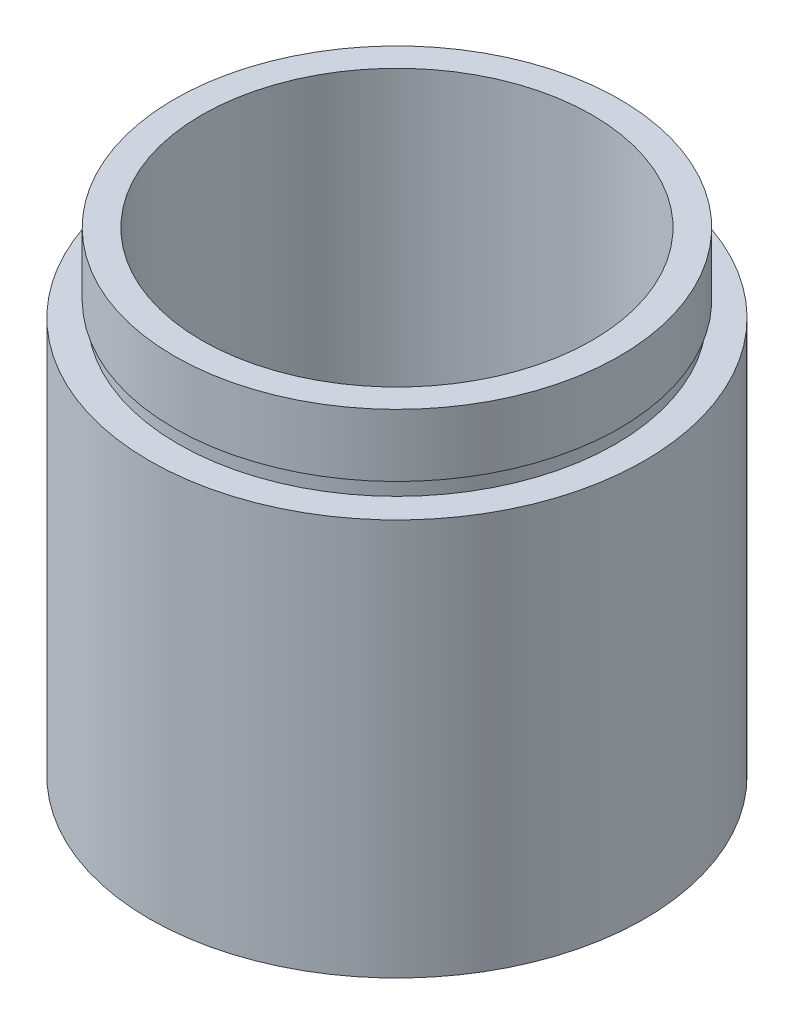
ISO-10303-21;
HEADER;
FILE_DESCRIPTION(('STEP AP214'),'2;1');
FILE_NAME('part.step','',(''),(''),'','','');
FILE_SCHEMA(('AUTOMOTIVE_DESIGN { 1 0 10303 214 1 1 1 1 }'));
ENDSEC;
DATA;
#1=APPLICATION_CONTEXT('core data for automotive mechanical design processes');
#2=APPLICATION_PROTOCOL_DEFINITION('international standard','automotive_design',2000,#1);
#3=PRODUCT_CONTEXT('',#1,'mechanical');
#4=PRODUCT('Part','Part','',(#3));
#5=PRODUCT_RELATED_PRODUCT_CATEGORY('part','',(#4));
#6=PRODUCT_DEFINITION_FORMATION('','',#4);
#7=PRODUCT_DEFINITION_CONTEXT('part definition',#1,'design');
#8=PRODUCT_DEFINITION('design','',#6,#7);
#9=PRODUCT_DEFINITION_SHAPE('','',#8);
#10=(LENGTH_UNIT() NAMED_UNIT(*) SI_UNIT(.MILLI.,.METRE.));
#11=(NAMED_UNIT(*) PLANE_ANGLE_UNIT() SI_UNIT($,.RADIAN.));
#12=(NAMED_UNIT(*) SI_UNIT($,.STERADIAN.) SOLID_ANGLE_UNIT());
#13=UNCERTAINTY_MEASURE_WITH_UNIT(LENGTH_MEASURE(1.E-05),#10,'distance_accuracy_value','');
#14=(GEOMETRIC_REPRESENTATION_CONTEXT(3) GLOBAL_UNCERTAINTY_ASSIGNED_CONTEXT((#13)) GLOBAL_UNIT_ASSIGNED_CONTEXT((#10,
#11,#12)) REPRESENTATION_CONTEXT('',''));
#15=CARTESIAN_POINT('',(0.,0.,0.));
#16=DIRECTION('',(0.,0.,1.));
#17=DIRECTION('',(1.,0.,0.));
#18=AXIS2_PLACEMENT_3D('',#15,#16,#17);
#19=CARTESIAN_POINT('',(14.25,0.,0.));
#20=DIRECTION('',(0.,1.,0.));
#21=DIRECTION('',(0.,0.,1.));
#22=AXIS2_PLACEMENT_3D('',#19,#20,#21);
#23=PLANE('',#22);
#24=CARTESIAN_POINT('',(0.,0.,0.));
#25=DIRECTION('',(0.,1.,0.));
#26=DIRECTION('',(0.,0.,1.));
#27=AXIS2_PLACEMENT_3D('',#24,#25,#26);
#28=CIRCLE('',#27,15.85);
#29=CARTESIAN_POINT('',(0.,0.,15.85));
#30=VERTEX_POINT('',#29);
#31=EDGE_CURVE('E10',#30,#30,#28,.T.);
#32=ORIENTED_EDGE('',*,*,#31,.F.);
#33=EDGE_LOOP('',(#32));
#34=FACE_BOUND('',#33,.T.);
#35=CARTESIAN_POINT('',(0.,0.,0.));
#36=DIRECTION('',(0.,1.,0.));
#37=DIRECTION('',(0.,0.,1.));
#38=AXIS2_PLACEMENT_3D('',#35,#36,#37);
#39=CIRCLE('',#38,14.25);
#40=CARTESIAN_POINT('',(0.,0.,14.25));
#41=VERTEX_POINT('',#40);
#42=EDGE_CURVE('E77',#41,#41,#39,.T.);
#43=ORIENTED_EDGE('',*,*,#42,.T.);
#44=EDGE_LOOP('',(#43));
#45=FACE_BOUND('',#44,.T.);
#46=ADVANCED_FACE('F37',(#34,#45),#23,.F.);
#47=CARTESIAN_POINT('',(0.,161.376166943427,0.));
#48=DIRECTION('',(0.,1.,0.));
#49=DIRECTION('',(0.,0.,1.));
#50=AXIS2_PLACEMENT_3D('',#47,#48,#49);
#51=CYLINDRICAL_SURFACE('',#50,15.85);
#52=CARTESIAN_POINT('',(0.,25.4,0.));
#53=DIRECTION('',(0.,1.,0.));
#54=DIRECTION('',(0.,0.,1.));
#55=AXIS2_PLACEMENT_3D('',#52,#53,#54);
#56=CIRCLE('',#55,15.85);
#57=CARTESIAN_POINT('',(0.,25.4,15.85));
#58=VERTEX_POINT('',#57);
#59=EDGE_CURVE('E43',#58,#58,#56,.T.);
#60=ORIENTED_EDGE('',*,*,#59,.F.);
#61=EDGE_LOOP('',(#60));
#62=FACE_BOUND('',#61,.T.);
#63=ORIENTED_EDGE('',*,*,#31,.T.);
#64=EDGE_LOOP('',(#63));
#65=FACE_BOUND('',#64,.T.);
#66=ADVANCED_FACE('F138',(#62,#65),#51,.T.);
#67=CARTESIAN_POINT('',(14.,25.4,0.));
#68=DIRECTION('',(0.,-1.,0.));
#69=DIRECTION('',(0.,0.,-1.));
#70=AXIS2_PLACEMENT_3D('',#67,#68,#69);
#71=PLANE('',#70);
#72=CARTESIAN_POINT('',(0.,25.4,0.));
#73=DIRECTION('',(0.,1.,0.));
#74=DIRECTION('',(0.,0.,1.));
#75=AXIS2_PLACEMENT_3D('',#72,#73,#74);
#76=CIRCLE('',#75,14.);
#77=CARTESIAN_POINT('',(0.,25.4,14.));
#78=VERTEX_POINT('',#77);
#79=EDGE_CURVE('E47',#78,#78,#76,.T.);
#80=ORIENTED_EDGE('',*,*,#79,.F.);
#81=EDGE_LOOP('',(#80));
#82=FACE_BOUND('',#81,.T.);
#83=ORIENTED_EDGE('',*,*,#59,.T.);
#84=EDGE_LOOP('',(#83));
#85=FACE_BOUND('',#84,.T.);
#86=ADVANCED_FACE('F133',(#82,#85),#71,.F.);
#87=CARTESIAN_POINT('',(0.,161.376166943427,0.));
#88=DIRECTION('',(0.,1.,0.));
#89=DIRECTION('',(0.,0.,1.));
#90=AXIS2_PLACEMENT_3D('',#87,#88,#89);
#91=CYLINDRICAL_SURFACE('',#90,14.);
#92=CARTESIAN_POINT('',(0.,26.4,0.));
#93=DIRECTION('',(0.,1.,0.));
#94=DIRECTION('',(0.,0.,1.));
#95=AXIS2_PLACEMENT_3D('',#92,#93,#94);
#96=CIRCLE('',#95,14.);
#97=CARTESIAN_POINT('',(0.,26.4,14.));
#98=VERTEX_POINT('',#97);
#99=EDGE_CURVE('E51',#98,#98,#96,.T.);
#100=ORIENTED_EDGE('',*,*,#99,.F.);
#101=EDGE_LOOP('',(#100));
#102=FACE_BOUND('',#101,.T.);
#103=ORIENTED_EDGE('',*,*,#79,.T.);
#104=EDGE_LOOP('',(#103));
#105=FACE_BOUND('',#104,.T.);
#106=ADVANCED_FACE('F127',(#102,#105),#91,.T.);
#107=CARTESIAN_POINT('',(14.,26.4,0.));
#108=DIRECTION('',(0.,1.,0.));
#109=DIRECTION('',(0.,0.,1.));
#110=AXIS2_PLACEMENT_3D('',#107,#108,#109);
#111=PLANE('',#110);
#112=CARTESIAN_POINT('',(0.,26.4,0.));
#113=DIRECTION('',(0.,1.,0.));
#114=DIRECTION('',(0.,0.,1.));
#115=AXIS2_PLACEMENT_3D('',#112,#113,#114);
#116=CIRCLE('',#115,14.25);
#117=CARTESIAN_POINT('',(0.,26.4,14.25));
#118=VERTEX_POINT('',#117);
#119=EDGE_CURVE('E56',#118,#118,#116,.T.);
#120=ORIENTED_EDGE('',*,*,#119,.F.);
#121=EDGE_LOOP('',(#120));
#122=FACE_BOUND('',#121,.T.);
#123=ORIENTED_EDGE('',*,*,#99,.T.);
#124=EDGE_LOOP('',(#123));
#125=FACE_BOUND('',#124,.T.);
#126=ADVANCED_FACE('F121',(#122,#125),#111,.F.);
#127=CARTESIAN_POINT('',(0.,161.376166943427,0.));
#128=DIRECTION('',(0.,1.,0.));
#129=DIRECTION('',(0.,0.,1.));
#130=AXIS2_PLACEMENT_3D('',#127,#128,#129);
#131=CYLINDRICAL_SURFACE('',#130,14.25);
#132=CARTESIAN_POINT('',(0.,30.4,0.));
#133=DIRECTION('',(0.,1.,0.));
#134=DIRECTION('',(0.,0.,1.));
#135=AXIS2_PLACEMENT_3D('',#132,#133,#134);
#136=CIRCLE('',#135,14.25);
#137=CARTESIAN_POINT('',(0.,30.4,14.25));
#138=VERTEX_POINT('',#137);
#139=EDGE_CURVE('E59',#138,#138,#136,.T.);
#140=ORIENTED_EDGE('',*,*,#139,.F.);
#141=EDGE_LOOP('',(#140));
#142=FACE_BOUND('',#141,.T.);
#143=ORIENTED_EDGE('',*,*,#119,.T.);
#144=EDGE_LOOP('',(#143));
#145=FACE_BOUND('',#144,.T.);
#146=ADVANCED_FACE('F115',(#142,#145),#131,.T.);
#147=CARTESIAN_POINT('',(12.5,30.4,0.));
#148=DIRECTION('',(0.,-1.,0.));
#149=DIRECTION('',(0.,0.,-1.));
#150=AXIS2_PLACEMENT_3D('',#147,#148,#149);
#151=PLANE('',#150);
#152=CARTESIAN_POINT('',(0.,30.4,0.));
#153=DIRECTION('',(0.,1.,0.));
#154=DIRECTION('',(0.,0.,1.));
#155=AXIS2_PLACEMENT_3D('',#152,#153,#154);
#156=CIRCLE('',#155,12.5);
#157=CARTESIAN_POINT('',(0.,30.4,12.5));
#158=VERTEX_POINT('',#157);
#159=EDGE_CURVE('E62',#158,#158,#156,.T.);
#160=ORIENTED_EDGE('',*,*,#159,.F.);
#161=EDGE_LOOP('',(#160));
#162=FACE_BOUND('',#161,.T.);
#163=ORIENTED_EDGE('',*,*,#139,.T.);
#164=EDGE_LOOP('',(#163));
#165=FACE_BOUND('',#164,.T.);
#166=ADVANCED_FACE('F109',(#162,#165),#151,.F.);
#167=CARTESIAN_POINT('',(0.,161.376166943427,0.));
#168=DIRECTION('',(0.,1.,0.));
#169=DIRECTION('',(0.,0.,1.));
#170=AXIS2_PLACEMENT_3D('',#167,#168,#169);
#171=CYLINDRICAL_SURFACE('',#170,12.5);
#172=CARTESIAN_POINT('',(0.,5.49999999999998,0.));
#173=DIRECTION('',(0.,1.,0.));
#174=DIRECTION('',(0.,0.,1.));
#175=AXIS2_PLACEMENT_3D('',#172,#173,#174);
#176=CIRCLE('',#175,12.5);
#177=CARTESIAN_POINT('',(0.,5.49999999999998,12.5));
#178=VERTEX_POINT('',#177);
#179=EDGE_CURVE('E65',#178,#178,#176,.T.);
#180=ORIENTED_EDGE('',*,*,#179,.F.);
#181=EDGE_LOOP('',(#180));
#182=FACE_BOUND('',#181,.T.);
#183=ORIENTED_EDGE('',*,*,#159,.T.);
#184=EDGE_LOOP('',(#183));
#185=FACE_BOUND('',#184,.T.);
#186=ADVANCED_FACE('F103',(#182,#185),#171,.F.);
#187=CARTESIAN_POINT('',(12.5,5.49999999999998,0.));
#188=DIRECTION('',(0.,1.,0.));
#189=DIRECTION('',(0.,0.,1.));
#190=AXIS2_PLACEMENT_3D('',#187,#188,#189);
#191=PLANE('',#190);
#192=CARTESIAN_POINT('',(0.,5.49999999999998,0.));
#193=DIRECTION('',(0.,1.,0.));
#194=DIRECTION('',(0.,0.,1.));
#195=AXIS2_PLACEMENT_3D('',#192,#193,#194);
#196=CIRCLE('',#195,14.35);
#197=CARTESIAN_POINT('',(0.,5.49999999999998,14.35));
#198=VERTEX_POINT('',#197);
#199=EDGE_CURVE('E68',#198,#198,#196,.T.);
#200=ORIENTED_EDGE('',*,*,#199,.F.);
#201=EDGE_LOOP('',(#200));
#202=FACE_BOUND('',#201,.T.);
#203=ORIENTED_EDGE('',*,*,#179,.T.);
#204=EDGE_LOOP('',(#203));
#205=FACE_BOUND('',#204,.T.);
#206=ADVANCED_FACE('F97',(#202,#205),#191,.F.);
#207=CARTESIAN_POINT('',(0.,161.376166943427,0.));
#208=DIRECTION('',(0.,1.,0.));
#209=DIRECTION('',(0.,0.,1.));
#210=AXIS2_PLACEMENT_3D('',#207,#208,#209);
#211=CYLINDRICAL_SURFACE('',#210,14.35);
#212=CARTESIAN_POINT('',(0.,4.49999999999998,0.));
#213=DIRECTION('',(0.,1.,0.));
#214=DIRECTION('',(0.,0.,1.));
#215=AXIS2_PLACEMENT_3D('',#212,#213,#214);
#216=CIRCLE('',#215,14.35);
#217=CARTESIAN_POINT('',(0.,4.49999999999998,14.35));
#218=VERTEX_POINT('',#217);
#219=EDGE_CURVE('E71',#218,#218,#216,.T.);
#220=ORIENTED_EDGE('',*,*,#219,.F.);
#221=EDGE_LOOP('',(#220));
#222=FACE_BOUND('',#221,.T.);
#223=ORIENTED_EDGE('',*,*,#199,.T.);
#224=EDGE_LOOP('',(#223));
#225=FACE_BOUND('',#224,.T.);
#226=ADVANCED_FACE('F91',(#222,#225),#211,.F.);
#227=CARTESIAN_POINT('',(14.25,4.50000000000001,0.));
#228=DIRECTION('',(0.,-1.,0.));
#229=DIRECTION('',(0.,0.,-1.));
#230=AXIS2_PLACEMENT_3D('',#227,#228,#229);
#231=PLANE('',#230);
#232=CARTESIAN_POINT('',(0.,4.50000000000003,0.));
#233=DIRECTION('',(0.,1.,0.));
#234=DIRECTION('',(0.,0.,1.));
#235=AXIS2_PLACEMENT_3D('',#232,#233,#234);
#236=CIRCLE('',#235,14.25);
#237=CARTESIAN_POINT('',(0.,4.50000000000003,14.25));
#238=VERTEX_POINT('',#237);
#239=EDGE_CURVE('E74',#238,#238,#236,.T.);
#240=ORIENTED_EDGE('',*,*,#239,.F.);
#241=EDGE_LOOP('',(#240));
#242=FACE_BOUND('',#241,.T.);
#243=ORIENTED_EDGE('',*,*,#219,.T.);
#244=EDGE_LOOP('',(#243));
#245=FACE_BOUND('',#244,.T.);
#246=ADVANCED_FACE('F85',(#242,#245),#231,.F.);
#247=CARTESIAN_POINT('',(0.,161.376166943427,0.));
#248=DIRECTION('',(0.,1.,0.));
#249=DIRECTION('',(0.,0.,1.));
#250=AXIS2_PLACEMENT_3D('',#247,#248,#249);
#251=CYLINDRICAL_SURFACE('',#250,14.25);
#252=ORIENTED_EDGE('',*,*,#42,.F.);
#253=EDGE_LOOP('',(#252));
#254=FACE_BOUND('',#253,.T.);
#255=ORIENTED_EDGE('',*,*,#239,.T.);
#256=EDGE_LOOP('',(#255));
#257=FACE_BOUND('',#256,.T.);
#258=ADVANCED_FACE('F82',(#254,#257),#251,.F.);
#259=CLOSED_SHELL('',(#46,#66,#86,#106,#126,#146,#166,#186,#206,#226,#246,#258));
#260=MANIFOLD_SOLID_BREP('B2',#259);
#261=ADVANCED_BREP_SHAPE_REPRESENTATION('',(#18,#260),#14);
#262=SHAPE_DEFINITION_REPRESENTATION(#9,#261);
ENDSEC;
END-ISO-10303-21;
